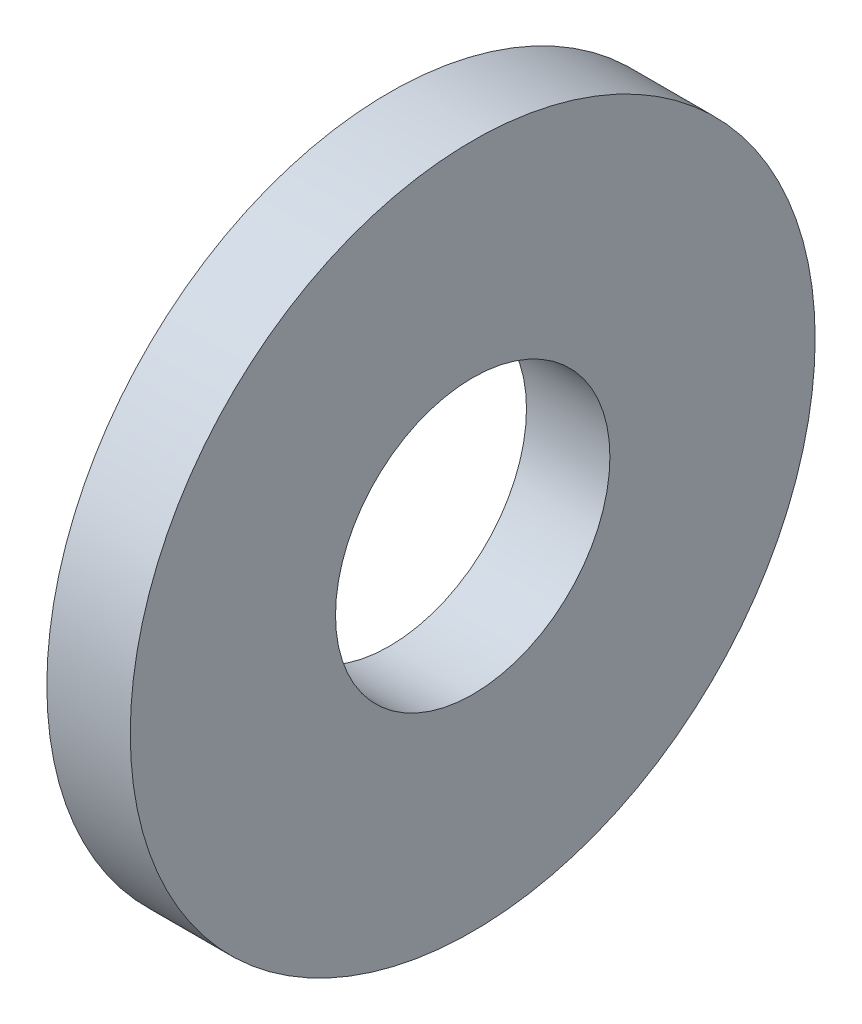
ISO-10303-21;
HEADER;
FILE_DESCRIPTION(('STEP AP214'),'2;1');
FILE_NAME('part.step','',(''),(''),'','','');
FILE_SCHEMA(('AUTOMOTIVE_DESIGN { 1 0 10303 214 1 1 1 1 }'));
ENDSEC;
DATA;
#1=APPLICATION_CONTEXT('core data for automotive mechanical design processes');
#2=APPLICATION_PROTOCOL_DEFINITION('international standard','automotive_design',2000,#1);
#3=PRODUCT_CONTEXT('',#1,'mechanical');
#4=PRODUCT('Part','Part','',(#3));
#5=PRODUCT_RELATED_PRODUCT_CATEGORY('part','',(#4));
#6=PRODUCT_DEFINITION_FORMATION('','',#4);
#7=PRODUCT_DEFINITION_CONTEXT('part definition',#1,'design');
#8=PRODUCT_DEFINITION('design','',#6,#7);
#9=PRODUCT_DEFINITION_SHAPE('','',#8);
#10=(LENGTH_UNIT() NAMED_UNIT(*) SI_UNIT(.MILLI.,.METRE.));
#11=(NAMED_UNIT(*) PLANE_ANGLE_UNIT() SI_UNIT($,.RADIAN.));
#12=(NAMED_UNIT(*) SI_UNIT($,.STERADIAN.) SOLID_ANGLE_UNIT());
#13=UNCERTAINTY_MEASURE_WITH_UNIT(LENGTH_MEASURE(1.E-05),#10,'distance_accuracy_value','');
#14=(GEOMETRIC_REPRESENTATION_CONTEXT(3) GLOBAL_UNCERTAINTY_ASSIGNED_CONTEXT((#13)) GLOBAL_UNIT_ASSIGNED_CONTEXT((#10,
#11,#12)) REPRESENTATION_CONTEXT('',''));
#15=CARTESIAN_POINT('',(0.,0.,0.));
#16=DIRECTION('',(0.,0.,1.));
#17=DIRECTION('',(1.,0.,0.));
#18=AXIS2_PLACEMENT_3D('',#15,#16,#17);
#19=CARTESIAN_POINT('',(0.9652,0.,0.));
#20=DIRECTION('',(1.,0.,0.));
#21=DIRECTION('',(0.,0.,-1.));
#22=AXIS2_PLACEMENT_3D('',#19,#20,#21);
#23=PLANE('',#22);
#24=CARTESIAN_POINT('',(0.9652,0.,0.));
#25=DIRECTION('',(1.,0.,0.));
#26=DIRECTION('',(0.,0.,-1.));
#27=AXIS2_PLACEMENT_3D('',#24,#25,#26);
#28=CIRCLE('',#27,3.9624);
#29=CARTESIAN_POINT('',(0.9652,0.,-3.9624));
#30=VERTEX_POINT('',#29);
#31=EDGE_CURVE('E12',#30,#30,#28,.T.);
#32=ORIENTED_EDGE('',*,*,#31,.T.);
#33=EDGE_LOOP('',(#32));
#34=FACE_BOUND('',#33,.T.);
#35=CARTESIAN_POINT('',(0.9652,0.,0.));
#36=DIRECTION('',(1.,0.,0.));
#37=DIRECTION('',(0.,0.,-1.));
#38=AXIS2_PLACEMENT_3D('',#35,#36,#37);
#39=CIRCLE('',#38,1.5875);
#40=CARTESIAN_POINT('',(0.9652,0.,-1.5875));
#41=VERTEX_POINT('',#40);
#42=EDGE_CURVE('E55',#41,#41,#39,.T.);
#43=ORIENTED_EDGE('',*,*,#42,.F.);
#44=EDGE_LOOP('',(#43));
#45=FACE_BOUND('',#44,.T.);
#46=ADVANCED_FACE('F44',(#34,#45),#23,.T.);
#47=CARTESIAN_POINT('',(0.,0.,0.));
#48=DIRECTION('',(1.,0.,0.));
#49=DIRECTION('',(0.,0.,-1.));
#50=AXIS2_PLACEMENT_3D('',#47,#48,#49);
#51=PLANE('',#50);
#52=CARTESIAN_POINT('',(0.,0.,0.));
#53=DIRECTION('',(1.,0.,0.));
#54=DIRECTION('',(0.,0.,-1.));
#55=AXIS2_PLACEMENT_3D('',#52,#53,#54);
#56=CIRCLE('',#55,3.9624);
#57=CARTESIAN_POINT('',(0.,0.,-3.9624));
#58=VERTEX_POINT('',#57);
#59=EDGE_CURVE('E48',#58,#58,#56,.T.);
#60=ORIENTED_EDGE('',*,*,#59,.F.);
#61=EDGE_LOOP('',(#60));
#62=FACE_BOUND('',#61,.T.);
#63=CARTESIAN_POINT('',(0.,0.,0.));
#64=DIRECTION('',(1.,0.,0.));
#65=DIRECTION('',(0.,0.,-1.));
#66=AXIS2_PLACEMENT_3D('',#63,#64,#65);
#67=CIRCLE('',#66,1.5875);
#68=CARTESIAN_POINT('',(0.,0.,-1.5875));
#69=VERTEX_POINT('',#68);
#70=EDGE_CURVE('E57',#69,#69,#67,.T.);
#71=ORIENTED_EDGE('',*,*,#70,.T.);
#72=EDGE_LOOP('',(#71));
#73=FACE_BOUND('',#72,.T.);
#74=ADVANCED_FACE('F67',(#62,#73),#51,.F.);
#75=CARTESIAN_POINT('',(0.9652,0.,0.));
#76=DIRECTION('',(-1.,0.,0.));
#77=DIRECTION('',(0.,0.,1.));
#78=AXIS2_PLACEMENT_3D('',#75,#76,#77);
#79=CYLINDRICAL_SURFACE('',#78,3.9624);
#80=ORIENTED_EDGE('',*,*,#31,.F.);
#81=EDGE_LOOP('',(#80));
#82=FACE_BOUND('',#81,.T.);
#83=ORIENTED_EDGE('',*,*,#59,.T.);
#84=EDGE_LOOP('',(#83));
#85=FACE_BOUND('',#84,.T.);
#86=ADVANCED_FACE('F46',(#82,#85),#79,.T.);
#87=CARTESIAN_POINT('',(0.9652,0.,0.));
#88=DIRECTION('',(-1.,0.,0.));
#89=DIRECTION('',(0.,0.,1.));
#90=AXIS2_PLACEMENT_3D('',#87,#88,#89);
#91=CYLINDRICAL_SURFACE('',#90,1.5875);
#92=ORIENTED_EDGE('',*,*,#42,.T.);
#93=EDGE_LOOP('',(#92));
#94=FACE_BOUND('',#93,.T.);
#95=ORIENTED_EDGE('',*,*,#70,.F.);
#96=EDGE_LOOP('',(#95));
#97=FACE_BOUND('',#96,.T.);
#98=ADVANCED_FACE('F63',(#94,#97),#91,.F.);
#99=CLOSED_SHELL('',(#46,#74,#86,#98));
#100=MANIFOLD_SOLID_BREP('B2',#99);
#101=ADVANCED_BREP_SHAPE_REPRESENTATION('',(#18,#100),#14);
#102=SHAPE_DEFINITION_REPRESENTATION(#9,#101);
ENDSEC;
END-ISO-10303-21;
